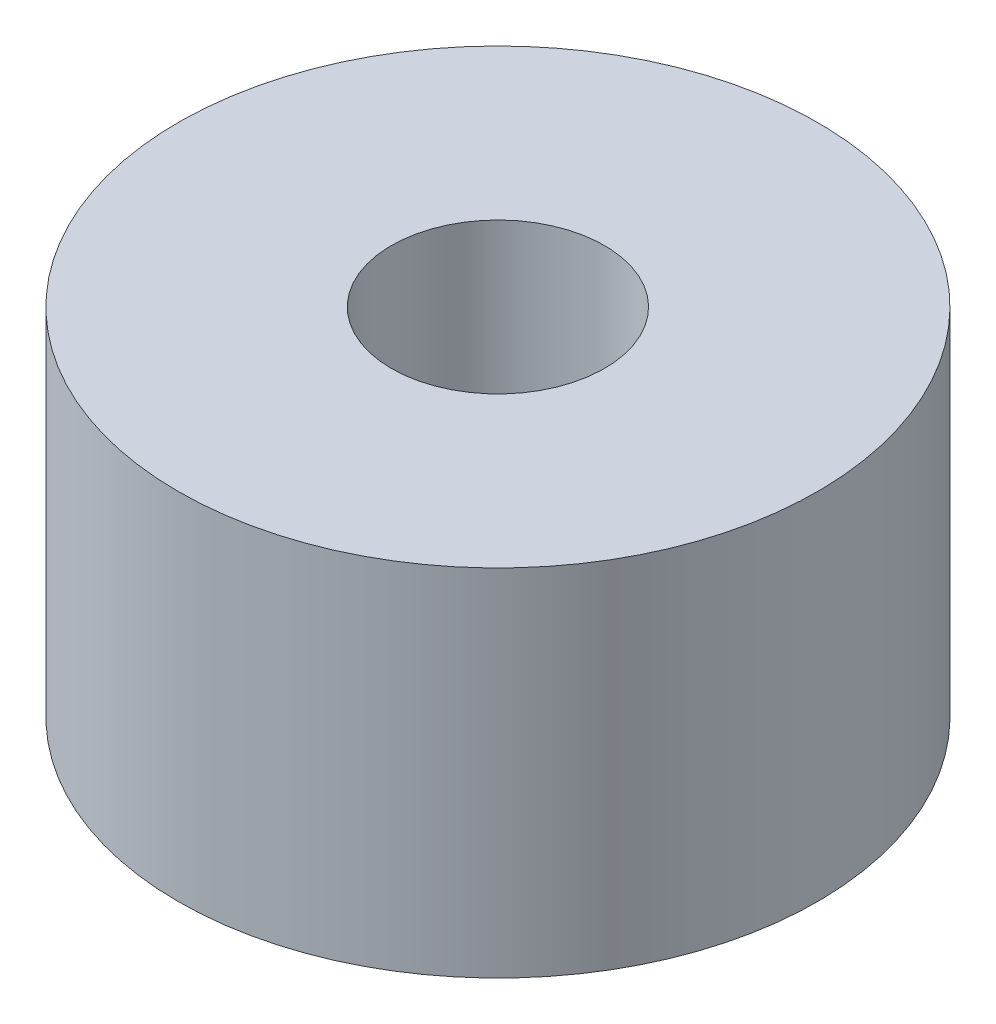
ISO-10303-21;
HEADER;
FILE_DESCRIPTION(('STEP AP214'),'2;1');
FILE_NAME('part.step','',(''),(''),'','','');
FILE_SCHEMA(('AUTOMOTIVE_DESIGN { 1 0 10303 214 1 1 1 1 }'));
ENDSEC;
DATA;
#1=APPLICATION_CONTEXT('core data for automotive mechanical design processes');
#2=APPLICATION_PROTOCOL_DEFINITION('international standard','automotive_design',2000,#1);
#3=PRODUCT_CONTEXT('',#1,'mechanical');
#4=PRODUCT('Part','Part','',(#3));
#5=PRODUCT_RELATED_PRODUCT_CATEGORY('part','',(#4));
#6=PRODUCT_DEFINITION_FORMATION('','',#4);
#7=PRODUCT_DEFINITION_CONTEXT('part definition',#1,'design');
#8=PRODUCT_DEFINITION('design','',#6,#7);
#9=PRODUCT_DEFINITION_SHAPE('','',#8);
#10=(LENGTH_UNIT() NAMED_UNIT(*) SI_UNIT(.MILLI.,.METRE.));
#11=(NAMED_UNIT(*) PLANE_ANGLE_UNIT() SI_UNIT($,.RADIAN.));
#12=(NAMED_UNIT(*) SI_UNIT($,.STERADIAN.) SOLID_ANGLE_UNIT());
#13=UNCERTAINTY_MEASURE_WITH_UNIT(LENGTH_MEASURE(1.E-05),#10,'distance_accuracy_value','');
#14=(GEOMETRIC_REPRESENTATION_CONTEXT(3) GLOBAL_UNCERTAINTY_ASSIGNED_CONTEXT((#13)) GLOBAL_UNIT_ASSIGNED_CONTEXT((#10,
#11,#12)) REPRESENTATION_CONTEXT('',''));
#15=CARTESIAN_POINT('',(0.,0.,0.));
#16=DIRECTION('',(0.,0.,1.));
#17=DIRECTION('',(1.,0.,0.));
#18=AXIS2_PLACEMENT_3D('',#15,#16,#17);
#19=CARTESIAN_POINT('',(0.,5.,0.));
#20=DIRECTION('',(0.,1.,0.));
#21=DIRECTION('',(0.,0.,1.));
#22=AXIS2_PLACEMENT_3D('',#19,#20,#21);
#23=PLANE('',#22);
#24=CARTESIAN_POINT('',(0.,5.,0.));
#25=DIRECTION('',(0.,1.,0.));
#26=DIRECTION('',(0.,0.,1.));
#27=AXIS2_PLACEMENT_3D('',#24,#25,#26);
#28=CIRCLE('',#27,4.5);
#29=CARTESIAN_POINT('',(0.,5.,4.5));
#30=VERTEX_POINT('',#29);
#31=EDGE_CURVE('E10',#30,#30,#28,.T.);
#32=ORIENTED_EDGE('',*,*,#31,.T.);
#33=EDGE_LOOP('',(#32));
#34=FACE_BOUND('',#33,.T.);
#35=CARTESIAN_POINT('',(0.,5.,0.));
#36=DIRECTION('',(0.,1.,0.));
#37=DIRECTION('',(0.,0.,1.));
#38=AXIS2_PLACEMENT_3D('',#35,#36,#37);
#39=CIRCLE('',#38,1.5);
#40=CARTESIAN_POINT('',(0.,5.,1.5));
#41=VERTEX_POINT('',#40);
#42=EDGE_CURVE('E44',#41,#41,#39,.T.);
#43=ORIENTED_EDGE('',*,*,#42,.F.);
#44=EDGE_LOOP('',(#43));
#45=FACE_BOUND('',#44,.T.);
#46=ADVANCED_FACE('F33',(#34,#45),#23,.T.);
#47=CARTESIAN_POINT('',(0.,0.,0.));
#48=DIRECTION('',(0.,1.,0.));
#49=DIRECTION('',(0.,0.,1.));
#50=AXIS2_PLACEMENT_3D('',#47,#48,#49);
#51=PLANE('',#50);
#52=CARTESIAN_POINT('',(0.,0.,0.));
#53=DIRECTION('',(0.,1.,0.));
#54=DIRECTION('',(0.,0.,1.));
#55=AXIS2_PLACEMENT_3D('',#52,#53,#54);
#56=CIRCLE('',#55,4.5);
#57=CARTESIAN_POINT('',(0.,0.,4.5));
#58=VERTEX_POINT('',#57);
#59=EDGE_CURVE('E37',#58,#58,#56,.T.);
#60=ORIENTED_EDGE('',*,*,#59,.F.);
#61=EDGE_LOOP('',(#60));
#62=FACE_BOUND('',#61,.T.);
#63=CARTESIAN_POINT('',(0.,0.,0.));
#64=DIRECTION('',(0.,1.,0.));
#65=DIRECTION('',(0.,0.,1.));
#66=AXIS2_PLACEMENT_3D('',#63,#64,#65);
#67=CIRCLE('',#66,1.5);
#68=CARTESIAN_POINT('',(0.,0.,1.5));
#69=VERTEX_POINT('',#68);
#70=EDGE_CURVE('E46',#69,#69,#67,.T.);
#71=ORIENTED_EDGE('',*,*,#70,.T.);
#72=EDGE_LOOP('',(#71));
#73=FACE_BOUND('',#72,.T.);
#74=ADVANCED_FACE('F56',(#62,#73),#51,.F.);
#75=CARTESIAN_POINT('',(0.,5.,0.));
#76=DIRECTION('',(0.,-1.,0.));
#77=DIRECTION('',(0.,0.,-1.));
#78=AXIS2_PLACEMENT_3D('',#75,#76,#77);
#79=CYLINDRICAL_SURFACE('',#78,4.5);
#80=ORIENTED_EDGE('',*,*,#31,.F.);
#81=EDGE_LOOP('',(#80));
#82=FACE_BOUND('',#81,.T.);
#83=ORIENTED_EDGE('',*,*,#59,.T.);
#84=EDGE_LOOP('',(#83));
#85=FACE_BOUND('',#84,.T.);
#86=ADVANCED_FACE('F35',(#82,#85),#79,.T.);
#87=CARTESIAN_POINT('',(0.,5.,0.));
#88=DIRECTION('',(0.,-1.,0.));
#89=DIRECTION('',(0.,0.,-1.));
#90=AXIS2_PLACEMENT_3D('',#87,#88,#89);
#91=CYLINDRICAL_SURFACE('',#90,1.5);
#92=ORIENTED_EDGE('',*,*,#42,.T.);
#93=EDGE_LOOP('',(#92));
#94=FACE_BOUND('',#93,.T.);
#95=ORIENTED_EDGE('',*,*,#70,.F.);
#96=EDGE_LOOP('',(#95));
#97=FACE_BOUND('',#96,.T.);
#98=ADVANCED_FACE('F52',(#94,#97),#91,.F.);
#99=CLOSED_SHELL('',(#46,#74,#86,#98));
#100=MANIFOLD_SOLID_BREP('B2',#99);
#101=ADVANCED_BREP_SHAPE_REPRESENTATION('',(#18,#100),#14);
#102=SHAPE_DEFINITION_REPRESENTATION(#9,#101);
ENDSEC;
END-ISO-10303-21;
